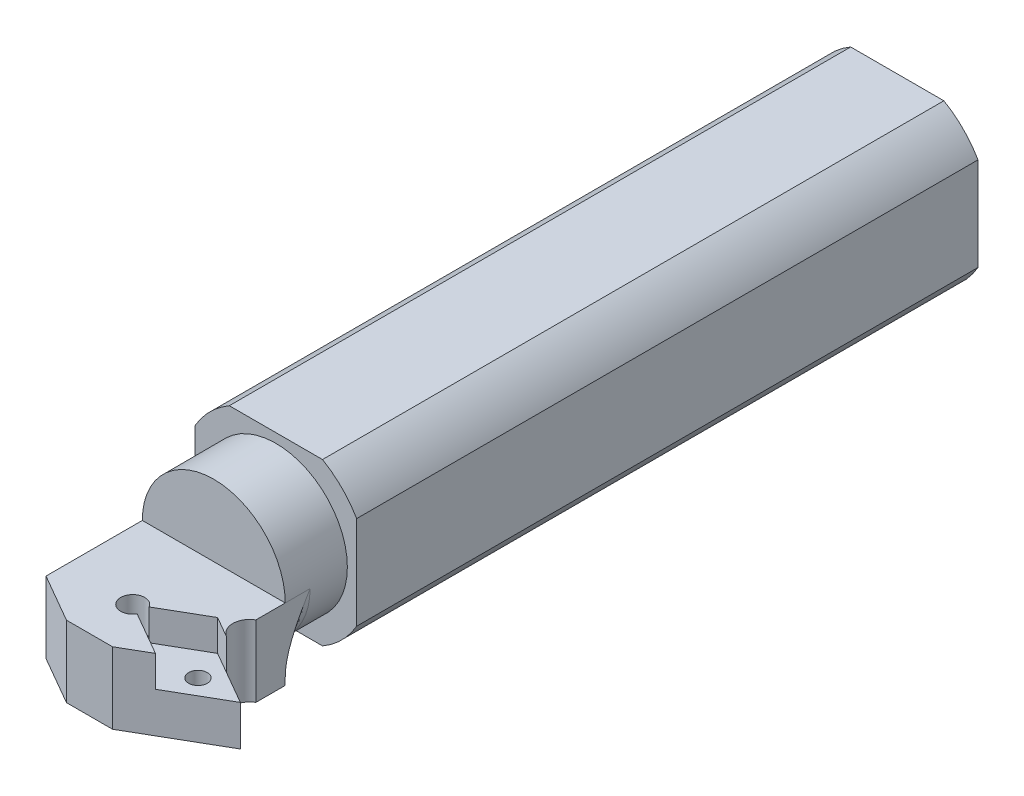
ISO-10303-21;
HEADER;
FILE_DESCRIPTION(('STEP AP214'),'2;1');
FILE_NAME('part.step','',(''),(''),'','','');
FILE_SCHEMA(('AUTOMOTIVE_DESIGN { 1 0 10303 214 1 1 1 1 }'));
ENDSEC;
DATA;
#1=APPLICATION_CONTEXT('core data for automotive mechanical design processes');
#2=APPLICATION_PROTOCOL_DEFINITION('international standard','automotive_design',2000,#1);
#3=PRODUCT_CONTEXT('',#1,'mechanical');
#4=PRODUCT('Part','Part','',(#3));
#5=PRODUCT_RELATED_PRODUCT_CATEGORY('part','',(#4));
#6=PRODUCT_DEFINITION_FORMATION('','',#4);
#7=PRODUCT_DEFINITION_CONTEXT('part definition',#1,'design');
#8=PRODUCT_DEFINITION('design','',#6,#7);
#9=PRODUCT_DEFINITION_SHAPE('','',#8);
#10=(LENGTH_UNIT() NAMED_UNIT(*) SI_UNIT(.MILLI.,.METRE.));
#11=(NAMED_UNIT(*) PLANE_ANGLE_UNIT() SI_UNIT($,.RADIAN.));
#12=(NAMED_UNIT(*) SI_UNIT($,.STERADIAN.) SOLID_ANGLE_UNIT());
#13=UNCERTAINTY_MEASURE_WITH_UNIT(LENGTH_MEASURE(1.E-05),#10,'distance_accuracy_value','');
#14=(GEOMETRIC_REPRESENTATION_CONTEXT(3) GLOBAL_UNCERTAINTY_ASSIGNED_CONTEXT((#13)) GLOBAL_UNIT_ASSIGNED_CONTEXT((#10,
#11,#12)) REPRESENTATION_CONTEXT('',''));
#15=CARTESIAN_POINT('',(0.,0.,0.));
#16=DIRECTION('',(0.,0.,1.));
#17=DIRECTION('',(1.,0.,0.));
#18=AXIS2_PLACEMENT_3D('',#15,#16,#17);
#19=CARTESIAN_POINT('',(16.7468570112552,-19.5147064715622,122.470725692152));
#20=DIRECTION('',(0.499999999999996,0.,-0.866025403784441));
#21=DIRECTION('',(-0.866025403784441,0.,-0.499999999999996));
#22=AXIS2_PLACEMENT_3D('',#19,#20,#21);
#23=PLANE('',#22);
#24=DIRECTION('',(0.,1.,0.));
#25=VECTOR('',#24,1.);
#26=CARTESIAN_POINT('',(11.5,-19.5147064715622,119.441451384305));
#27=LINE('',#26,#25);
#28=CARTESIAN_POINT('',(11.5,-11.5,119.441451384305));
#29=VERTEX_POINT('',#28);
#30=CARTESIAN_POINT('',(11.5,-5.,119.441451384305));
#31=VERTEX_POINT('',#30);
#32=EDGE_CURVE('E257',#29,#31,#27,.T.);
#33=ORIENTED_EDGE('',*,*,#32,.T.);
#34=DIRECTION('',(-0.86602540378444,0.,-0.499999999999998));
#35=VECTOR('',#34,1.);
#36=CARTESIAN_POINT('',(16.7468570112552,-5.,122.470725692152));
#37=LINE('',#36,#35);
#38=CARTESIAN_POINT('',(16.7468570112552,-5.,122.470725692152));
#39=VERTEX_POINT('',#38);
#40=EDGE_CURVE('E52',#39,#31,#37,.T.);
#41=ORIENTED_EDGE('',*,*,#40,.F.);
#42=DIRECTION('',(0.,1.,0.));
#43=VECTOR('',#42,1.);
#44=CARTESIAN_POINT('',(16.7468570112552,-19.5147064715622,122.470725692152));
#45=LINE('',#44,#43);
#46=CARTESIAN_POINT('',(16.7468570112552,-11.5,122.470725692152));
#47=VERTEX_POINT('',#46);
#48=EDGE_CURVE('E252',#47,#39,#45,.T.);
#49=ORIENTED_EDGE('',*,*,#48,.F.);
#50=DIRECTION('',(0.866025403784441,0.,0.499999999999996));
#51=VECTOR('',#50,1.);
#52=CARTESIAN_POINT('',(16.7468570112552,-11.5,122.470725692152));
#53=LINE('',#52,#51);
#54=EDGE_CURVE('E253',#29,#47,#53,.T.);
#55=ORIENTED_EDGE('',*,*,#54,.F.);
#56=EDGE_LOOP('',(#33,#41,#49,#55));
#57=FACE_BOUND('',#56,.T.);
#58=ADVANCED_FACE('F36',(#57),#23,.T.);
#59=CARTESIAN_POINT('',(0.,0.,106.));
#60=DIRECTION('',(0.,0.,1.));
#61=DIRECTION('',(1.,0.,0.));
#62=AXIS2_PLACEMENT_3D('',#59,#60,#61);
#63=TOROIDAL_SURFACE('',#62,15.5,4.);
#64=CARTESIAN_POINT('',(0.,0.,106.));
#65=DIRECTION('',(0.,0.,1.));
#66=DIRECTION('',(1.,0.,0.));
#67=AXIS2_PLACEMENT_3D('',#64,#65,#66);
#68=CIRCLE('',#67,11.5);
#69=CARTESIAN_POINT('',(0.,-11.5,106.));
#70=VERTEX_POINT('',#69);
#71=CARTESIAN_POINT('',(-11.5,0.,106.));
#72=VERTEX_POINT('',#71);
#73=EDGE_CURVE('E504',#70,#72,#68,.F.);
#74=ORIENTED_EDGE('',*,*,#73,.F.);
#75=CARTESIAN_POINT('',(-10.3923048454133,-11.5,110.));
#76=CARTESIAN_POINT('',(-10.2451841637041,-11.5,109.999995353823));
#77=CARTESIAN_POINT('',(-10.0981014925065,-11.5,109.996351872541));
#78=CARTESIAN_POINT('',(-9.80430970715391,-11.5,109.982271051299));
#79=CARTESIAN_POINT('',(-9.65760048024015,-11.5,109.971836090423));
#80=CARTESIAN_POINT('',(-9.2189728978769,-11.5,109.931125310246));
#81=CARTESIAN_POINT('',(-8.92790111409655,-11.5,109.89143924046));
#82=CARTESIAN_POINT('',(-8.35391138957464,-11.5,109.791209104945));
#83=CARTESIAN_POINT('',(-8.07093649289131,-11.5,109.730980649954));
#84=CARTESIAN_POINT('',(-7.50930629539151,-11.5,109.592502408286));
#85=CARTESIAN_POINT('',(-7.23065356345786,-11.5,109.514242311894));
#86=CARTESIAN_POINT('',(-6.64736044802873,-11.5,109.332812570734));
#87=CARTESIAN_POINT('',(-6.34328573757482,-11.5,109.227838663538));
#88=CARTESIAN_POINT('',(-5.74098725075429,-11.5,109.002167712969));
#89=CARTESIAN_POINT('',(-5.44276530894077,-11.5,108.881465827442));
#90=CARTESIAN_POINT('',(-4.5559417041763,-11.5,108.499952640748));
#91=CARTESIAN_POINT('',(-3.9756529329935,-11.5,108.21988963367));
#92=CARTESIAN_POINT('',(-2.82805484305605,-11.5,107.626246509483));
#93=CARTESIAN_POINT('',(-2.26086026559053,-11.5,107.312451926835));
#94=CARTESIAN_POINT('',(-1.13524598700925,-11.5,106.669427325131));
#95=CARTESIAN_POINT('',(-0.57682838525103,-11.5,106.340193686037));
#96=CARTESIAN_POINT('',(-0.0123160279512834,-11.5,106.007263595772));
#97=CARTESIAN_POINT('',(-0.00615801307420656,-11.5,106.003631796708));
#98=CARTESIAN_POINT('',(0.,-11.5,106.));
#99=B_SPLINE_CURVE_WITH_KNOTS('',3,(#75,#76,#77,#78,#79,#80,#81,#82,#83,#84,#85,#86,#87,#88,#89,
#90,#91,#92,#93,#94,#95,#96,#97,#98),.UNSPECIFIED.,.F.,.F.,(4,2,2,2,2,2,2,2,2,2,2,4),(0.,
0.441254468850673,0.882354447492294,1.76260081662264,2.62989068160847,3.49767766159483,
4.46219925938463,5.42701850799611,7.35813850539926,9.30235757735884,11.2470348176778,
11.2684824282677),.UNSPECIFIED.);
#100=CARTESIAN_POINT('',(-10.3923048454133,-11.5,110.));
#101=VERTEX_POINT('',#100);
#102=EDGE_CURVE('E460',#70,#101,#99,.F.);
#103=ORIENTED_EDGE('',*,*,#102,.T.);
#104=CARTESIAN_POINT('',(0.,0.,110.));
#105=DIRECTION('',(0.,0.,1.));
#106=DIRECTION('',(1.,0.,0.));
#107=AXIS2_PLACEMENT_3D('',#104,#105,#106);
#108=CIRCLE('',#107,15.5);
#109=CARTESIAN_POINT('',(-11.5,-10.3923048454133,110.));
#110=VERTEX_POINT('',#109);
#111=EDGE_CURVE('E505',#110,#101,#108,.T.);
#112=ORIENTED_EDGE('',*,*,#111,.F.);
#113=CARTESIAN_POINT('',(-11.5,-10.3923048454133,110.));
#114=CARTESIAN_POINT('',(-11.5,-10.2451841637041,109.999995353823));
#115=CARTESIAN_POINT('',(-11.5,-10.0981014925065,109.996351872541));
#116=CARTESIAN_POINT('',(-11.5,-9.80430970715391,109.982271051299));
#117=CARTESIAN_POINT('',(-11.5,-9.65760048024015,109.971836090423));
#118=CARTESIAN_POINT('',(-11.5,-9.2189728978769,109.931125310246));
#119=CARTESIAN_POINT('',(-11.5,-8.92790111409655,109.89143924046));
#120=CARTESIAN_POINT('',(-11.5,-8.35391138957464,109.791209104945));
#121=CARTESIAN_POINT('',(-11.5,-8.07093649289131,109.730980649954));
#122=CARTESIAN_POINT('',(-11.5,-7.50930629539151,109.592502408286));
#123=CARTESIAN_POINT('',(-11.5,-7.23065356345786,109.514242311894));
#124=CARTESIAN_POINT('',(-11.5,-6.64736044802873,109.332812570734));
#125=CARTESIAN_POINT('',(-11.5,-6.34328573757482,109.227838663538));
#126=CARTESIAN_POINT('',(-11.5,-5.74098725075429,109.002167712969));
#127=CARTESIAN_POINT('',(-11.5,-5.44276530894077,108.881465827442));
#128=CARTESIAN_POINT('',(-11.5,-4.5559417041763,108.499952640748));
#129=CARTESIAN_POINT('',(-11.5,-3.9756529329935,108.21988963367));
#130=CARTESIAN_POINT('',(-11.5,-2.82805484305605,107.626246509483));
#131=CARTESIAN_POINT('',(-11.5,-2.26086026559053,107.312451926835));
#132=CARTESIAN_POINT('',(-11.5,-1.13524598700925,106.669427325131));
#133=CARTESIAN_POINT('',(-11.5,-0.57682838525103,106.340193686037));
#134=CARTESIAN_POINT('',(-11.5,-0.0123160279512834,106.007263595772));
#135=CARTESIAN_POINT('',(-11.5,-0.00615801307420656,106.003631796708));
#136=CARTESIAN_POINT('',(-11.5,0.,106.));
#137=B_SPLINE_CURVE_WITH_KNOTS('',3,(#113,#114,#115,#116,#117,#118,#119,#120,#121,#122,#123,
#124,#125,#126,#127,#128,#129,#130,#131,#132,#133,#134,#135,#136),.UNSPECIFIED.,.F.,.F.,(4,2,2,
2,2,2,2,2,2,2,2,4),(0.,0.441254468850673,0.882354447492294,1.76260081662264,2.62989068160847,
3.49767766159483,4.46219925938463,5.42701850799611,7.35813850539926,9.30235757735884,
11.2470348176778,11.2684824282677),.UNSPECIFIED.);
#138=EDGE_CURVE('E454',#110,#72,#137,.T.);
#139=ORIENTED_EDGE('',*,*,#138,.T.);
#140=EDGE_LOOP('',(#74,#103,#112,#139));
#141=FACE_BOUND('',#140,.T.);
#142=ADVANCED_FACE('F38',(#141),#63,.F.);
#143=CARTESIAN_POINT('',(0.,0.,106.));
#144=DIRECTION('',(0.,0.,1.));
#145=DIRECTION('',(1.,0.,0.));
#146=AXIS2_PLACEMENT_3D('',#143,#144,#145);
#147=TOROIDAL_SURFACE('',#146,15.5,4.);
#148=CARTESIAN_POINT('',(0.,0.,106.));
#149=DIRECTION('',(0.,0.,1.));
#150=DIRECTION('',(1.,0.,0.));
#151=AXIS2_PLACEMENT_3D('',#148,#149,#150);
#152=CIRCLE('',#151,11.5);
#153=CARTESIAN_POINT('',(11.5,0.,106.));
#154=VERTEX_POINT('',#153);
#155=CARTESIAN_POINT('',(7.71041972401629,-8.53225806451613,106.));
#156=VERTEX_POINT('',#155);
#157=EDGE_CURVE('E366',#154,#156,#152,.F.);
#158=ORIENTED_EDGE('',*,*,#157,.F.);
#159=CARTESIAN_POINT('',(11.5,-10.3923048454133,110.));
#160=CARTESIAN_POINT('',(11.5,-10.2451841637041,109.999995353823));
#161=CARTESIAN_POINT('',(11.5,-10.0981014925065,109.996351872541));
#162=CARTESIAN_POINT('',(11.5,-9.80430970715391,109.982271051299));
#163=CARTESIAN_POINT('',(11.5,-9.65760048024015,109.971836090423));
#164=CARTESIAN_POINT('',(11.5,-9.2189728978769,109.931125310246));
#165=CARTESIAN_POINT('',(11.5,-8.92790111409655,109.89143924046));
#166=CARTESIAN_POINT('',(11.5,-8.35391138957464,109.791209104945));
#167=CARTESIAN_POINT('',(11.5,-8.07093649289131,109.730980649954));
#168=CARTESIAN_POINT('',(11.5,-7.50930629539151,109.592502408286));
#169=CARTESIAN_POINT('',(11.5,-7.23065356345786,109.514242311894));
#170=CARTESIAN_POINT('',(11.5,-6.64736044802873,109.332812570734));
#171=CARTESIAN_POINT('',(11.5,-6.34328573757482,109.227838663538));
#172=CARTESIAN_POINT('',(11.5,-5.74098725075429,109.002167712969));
#173=CARTESIAN_POINT('',(11.5,-5.44276530894077,108.881465827442));
#174=CARTESIAN_POINT('',(11.5,-4.5559417041763,108.499952640748));
#175=CARTESIAN_POINT('',(11.5,-3.9756529329935,108.21988963367));
#176=CARTESIAN_POINT('',(11.5,-2.82805484305605,107.626246509483));
#177=CARTESIAN_POINT('',(11.5,-2.26086026559053,107.312451926835));
#178=CARTESIAN_POINT('',(11.5,-1.13524598700925,106.669427325131));
#179=CARTESIAN_POINT('',(11.5,-0.57682838525103,106.340193686037));
#180=CARTESIAN_POINT('',(11.5,-0.0123160279512834,106.007263595772));
#181=CARTESIAN_POINT('',(11.5,-0.00615801307420656,106.003631796708));
#182=CARTESIAN_POINT('',(11.5,0.,106.));
#183=B_SPLINE_CURVE_WITH_KNOTS('',3,(#159,#160,#161,#162,#163,#164,#165,#166,#167,#168,#169,
#170,#171,#172,#173,#174,#175,#176,#177,#178,#179,#180,#181,#182),.UNSPECIFIED.,.F.,.F.,(4,2,2,
2,2,2,2,2,2,2,2,4),(0.,0.441254468850673,0.882354447492294,1.76260081662264,2.62989068160847,
3.49767766159483,4.46219925938463,5.42701850799611,7.35813850539926,9.30235757735884,
11.2470348176778,11.2684824282677),.UNSPECIFIED.);
#184=CARTESIAN_POINT('',(11.5,-10.3923048454133,110.));
#185=VERTEX_POINT('',#184);
#186=EDGE_CURVE('E374',#154,#185,#183,.F.);
#187=ORIENTED_EDGE('',*,*,#186,.T.);
#188=CARTESIAN_POINT('',(0.,0.,110.));
#189=DIRECTION('',(0.,0.,1.));
#190=DIRECTION('',(1.,0.,0.));
#191=AXIS2_PLACEMENT_3D('',#188,#189,#190);
#192=CIRCLE('',#191,15.5);
#193=CARTESIAN_POINT('',(10.3923048454133,-11.5,110.));
#194=VERTEX_POINT('',#193);
#195=EDGE_CURVE('E371',#194,#185,#192,.T.);
#196=ORIENTED_EDGE('',*,*,#195,.F.);
#197=CARTESIAN_POINT('',(10.3923048454133,-11.5,110.));
#198=CARTESIAN_POINT('',(10.2451841637041,-11.5,109.999995353823));
#199=CARTESIAN_POINT('',(10.0981014925065,-11.5,109.996351872541));
#200=CARTESIAN_POINT('',(9.80430970715391,-11.5,109.982271051299));
#201=CARTESIAN_POINT('',(9.65760048024015,-11.5,109.971836090423));
#202=CARTESIAN_POINT('',(9.2189728978769,-11.5,109.931125310246));
#203=CARTESIAN_POINT('',(8.92790111409655,-11.5,109.89143924046));
#204=CARTESIAN_POINT('',(8.35391138957464,-11.5,109.791209104945));
#205=CARTESIAN_POINT('',(8.07093649289131,-11.5,109.730980649954));
#206=CARTESIAN_POINT('',(7.50930629539151,-11.5,109.592502408286));
#207=CARTESIAN_POINT('',(7.23065356345786,-11.5,109.514242311894));
#208=CARTESIAN_POINT('',(6.64736044802873,-11.5,109.332812570734));
#209=CARTESIAN_POINT('',(6.34328573757482,-11.5,109.227838663538));
#210=CARTESIAN_POINT('',(5.74098725075429,-11.5,109.002167712969));
#211=CARTESIAN_POINT('',(5.44276530894077,-11.5,108.881465827442));
#212=CARTESIAN_POINT('',(4.5559417041763,-11.5,108.499952640748));
#213=CARTESIAN_POINT('',(3.9756529329935,-11.5,108.21988963367));
#214=CARTESIAN_POINT('',(2.82805484305605,-11.5,107.626246509483));
#215=CARTESIAN_POINT('',(2.26086026559053,-11.5,107.312451926835));
#216=CARTESIAN_POINT('',(1.13524598700925,-11.5,106.669427325131));
#217=CARTESIAN_POINT('',(0.57682838525103,-11.5,106.340193686037));
#218=CARTESIAN_POINT('',(0.0123160279512834,-11.5,106.007263595772));
#219=CARTESIAN_POINT('',(0.00615801307420656,-11.5,106.003631796708));
#220=CARTESIAN_POINT('',(0.,-11.5,106.));
#221=B_SPLINE_CURVE_WITH_KNOTS('',3,(#197,#198,#199,#200,#201,#202,#203,#204,#205,#206,#207,
#208,#209,#210,#211,#212,#213,#214,#215,#216,#217,#218,#219,#220),.UNSPECIFIED.,.F.,.F.,(4,2,2,
2,2,2,2,2,2,2,2,4),(0.,0.441254468850673,0.882354447492294,1.76260081662264,2.62989068160847,
3.49767766159483,4.46219925938463,5.42701850799611,7.35813850539926,9.30235757735884,
11.2470348176778,11.2684824282677),.UNSPECIFIED.);
#222=EDGE_CURVE('E381',#194,#70,#221,.T.);
#223=ORIENTED_EDGE('',*,*,#222,.T.);
#224=CARTESIAN_POINT('',(0.,0.,106.));
#225=DIRECTION('',(0.,0.,1.));
#226=DIRECTION('',(1.,0.,0.));
#227=AXIS2_PLACEMENT_3D('',#224,#225,#226);
#228=CIRCLE('',#227,11.5);
#229=EDGE_CURVE('E363',#156,#70,#228,.F.);
#230=ORIENTED_EDGE('',*,*,#229,.F.);
#231=EDGE_LOOP('',(#158,#187,#196,#223,#230));
#232=FACE_BOUND('',#231,.T.);
#233=ADVANCED_FACE('F391',(#232),#147,.F.);
#234=CARTESIAN_POINT('',(0.,0.,100.));
#235=DIRECTION('',(0.,0.,1.));
#236=DIRECTION('',(1.,0.,0.));
#237=AXIS2_PLACEMENT_3D('',#234,#235,#236);
#238=PLANE('',#237);
#239=CARTESIAN_POINT('',(0.,0.,100.));
#240=DIRECTION('',(0.,0.,1.));
#241=DIRECTION('',(1.,0.,0.));
#242=AXIS2_PLACEMENT_3D('',#239,#240,#241);
#243=CIRCLE('',#242,15.);
#244=CARTESIAN_POINT('',(-7.5,12.9903810567666,100.));
#245=VERTEX_POINT('',#244);
#246=CARTESIAN_POINT('',(-12.9903810567666,7.5,100.));
#247=VERTEX_POINT('',#246);
#248=EDGE_CURVE('E306',#245,#247,#243,.T.);
#249=ORIENTED_EDGE('',*,*,#248,.T.);
#250=DIRECTION('',(0.,-1.,0.));
#251=VECTOR('',#250,1.);
#252=CARTESIAN_POINT('',(-12.9903810567666,7.5,100.));
#253=LINE('',#252,#251);
#254=CARTESIAN_POINT('',(-12.9903810567666,-7.5,100.));
#255=VERTEX_POINT('',#254);
#256=EDGE_CURVE('E309',#247,#255,#253,.T.);
#257=ORIENTED_EDGE('',*,*,#256,.T.);
#258=CARTESIAN_POINT('',(0.,0.,100.));
#259=DIRECTION('',(0.,0.,1.));
#260=DIRECTION('',(1.,0.,0.));
#261=AXIS2_PLACEMENT_3D('',#258,#259,#260);
#262=CIRCLE('',#261,15.);
#263=CARTESIAN_POINT('',(-7.5,-12.9903810567666,100.));
#264=VERTEX_POINT('',#263);
#265=EDGE_CURVE('E312',#255,#264,#262,.T.);
#266=ORIENTED_EDGE('',*,*,#265,.T.);
#267=DIRECTION('',(1.,0.,0.));
#268=VECTOR('',#267,1.);
#269=CARTESIAN_POINT('',(7.5,-12.9903810567666,100.));
#270=LINE('',#269,#268);
#271=CARTESIAN_POINT('',(7.49999999999999,-12.9903810567666,100.));
#272=VERTEX_POINT('',#271);
#273=EDGE_CURVE('E314',#264,#272,#270,.T.);
#274=ORIENTED_EDGE('',*,*,#273,.T.);
#275=CARTESIAN_POINT('',(0.,0.,100.));
#276=DIRECTION('',(0.,0.,1.));
#277=DIRECTION('',(1.,0.,0.));
#278=AXIS2_PLACEMENT_3D('',#275,#276,#277);
#279=CIRCLE('',#278,15.);
#280=CARTESIAN_POINT('',(12.9903810567666,-7.5,100.));
#281=VERTEX_POINT('',#280);
#282=EDGE_CURVE('E316',#272,#281,#279,.T.);
#283=ORIENTED_EDGE('',*,*,#282,.T.);
#284=DIRECTION('',(0.,1.,0.));
#285=VECTOR('',#284,1.);
#286=CARTESIAN_POINT('',(12.9903810567666,7.5,100.));
#287=LINE('',#286,#285);
#288=CARTESIAN_POINT('',(12.9903810567666,7.5,100.));
#289=VERTEX_POINT('',#288);
#290=EDGE_CURVE('E318',#281,#289,#287,.T.);
#291=ORIENTED_EDGE('',*,*,#290,.T.);
#292=CARTESIAN_POINT('',(0.,0.,100.));
#293=DIRECTION('',(0.,0.,1.));
#294=DIRECTION('',(1.,0.,0.));
#295=AXIS2_PLACEMENT_3D('',#292,#293,#294);
#296=CIRCLE('',#295,15.);
#297=CARTESIAN_POINT('',(7.5,12.9903810567666,100.));
#298=VERTEX_POINT('',#297);
#299=EDGE_CURVE('E320',#289,#298,#296,.T.);
#300=ORIENTED_EDGE('',*,*,#299,.T.);
#301=DIRECTION('',(-1.,0.,0.));
#302=VECTOR('',#301,1.);
#303=CARTESIAN_POINT('',(-7.5,12.9903810567666,100.));
#304=LINE('',#303,#302);
#305=EDGE_CURVE('E322',#298,#245,#304,.T.);
#306=ORIENTED_EDGE('',*,*,#305,.T.);
#307=EDGE_LOOP('',(#249,#257,#266,#274,#283,#291,#300,#306));
#308=FACE_BOUND('',#307,.T.);
#309=CARTESIAN_POINT('',(0.,0.,100.));
#310=DIRECTION('',(0.,0.,1.));
#311=DIRECTION('',(1.,0.,0.));
#312=AXIS2_PLACEMENT_3D('',#309,#310,#311);
#313=CIRCLE('',#312,11.5);
#314=CARTESIAN_POINT('',(11.5,0.,100.));
#315=VERTEX_POINT('',#314);
#316=EDGE_CURVE('E299',#315,#315,#313,.T.);
#317=ORIENTED_EDGE('',*,*,#316,.F.);
#318=EDGE_LOOP('',(#317));
#319=FACE_BOUND('',#318,.T.);
#320=ADVANCED_FACE('F395',(#308,#319),#238,.T.);
#321=CARTESIAN_POINT('',(0.,0.,100.));
#322=DIRECTION('',(0.,0.,-1.));
#323=DIRECTION('',(-1.,0.,0.));
#324=AXIS2_PLACEMENT_3D('',#321,#322,#323);
#325=CYLINDRICAL_SURFACE('',#324,15.);
#326=CARTESIAN_POINT('',(0.,0.,0.));
#327=DIRECTION('',(0.,0.,1.));
#328=DIRECTION('',(1.,0.,0.));
#329=AXIS2_PLACEMENT_3D('',#326,#327,#328);
#330=CIRCLE('',#329,15.);
#331=CARTESIAN_POINT('',(-7.5,12.9903810567666,0.));
#332=VERTEX_POINT('',#331);
#333=CARTESIAN_POINT('',(-12.9903810567666,7.5,0.));
#334=VERTEX_POINT('',#333);
#335=EDGE_CURVE('E303',#332,#334,#330,.T.);
#336=ORIENTED_EDGE('',*,*,#335,.T.);
#337=DIRECTION('',(0.,0.,-1.));
#338=VECTOR('',#337,1.);
#339=CARTESIAN_POINT('',(-12.9903810567666,7.5,100.));
#340=LINE('',#339,#338);
#341=EDGE_CURVE('E360',#247,#334,#340,.T.);
#342=ORIENTED_EDGE('',*,*,#341,.F.);
#343=ORIENTED_EDGE('',*,*,#248,.F.);
#344=DIRECTION('',(0.,0.,-1.));
#345=VECTOR('',#344,1.);
#346=CARTESIAN_POINT('',(-7.5,12.9903810567666,100.));
#347=LINE('',#346,#345);
#348=EDGE_CURVE('E324',#245,#332,#347,.T.);
#349=ORIENTED_EDGE('',*,*,#348,.T.);
#350=EDGE_LOOP('',(#336,#342,#343,#349));
#351=FACE_BOUND('',#350,.T.);
#352=ADVANCED_FACE('F397',(#351),#325,.T.);
#353=CARTESIAN_POINT('',(-12.9903810567666,7.5,100.));
#354=DIRECTION('',(1.,0.,0.));
#355=DIRECTION('',(0.,0.,-1.));
#356=AXIS2_PLACEMENT_3D('',#353,#354,#355);
#357=PLANE('',#356);
#358=DIRECTION('',(0.,-1.,0.));
#359=VECTOR('',#358,1.);
#360=CARTESIAN_POINT('',(-12.9903810567666,7.5,0.));
#361=LINE('',#360,#359);
#362=CARTESIAN_POINT('',(-12.9903810567666,-7.5,0.));
#363=VERTEX_POINT('',#362);
#364=EDGE_CURVE('E327',#334,#363,#361,.T.);
#365=ORIENTED_EDGE('',*,*,#364,.T.);
#366=DIRECTION('',(0.,0.,-1.));
#367=VECTOR('',#366,1.);
#368=CARTESIAN_POINT('',(-12.9903810567666,-7.5,100.));
#369=LINE('',#368,#367);
#370=EDGE_CURVE('E357',#255,#363,#369,.T.);
#371=ORIENTED_EDGE('',*,*,#370,.F.);
#372=ORIENTED_EDGE('',*,*,#256,.F.);
#373=ORIENTED_EDGE('',*,*,#341,.T.);
#374=EDGE_LOOP('',(#365,#371,#372,#373));
#375=FACE_BOUND('',#374,.T.);
#376=ADVANCED_FACE('F401',(#375),#357,.F.);
#377=CARTESIAN_POINT('',(0.,0.,100.));
#378=DIRECTION('',(0.,0.,-1.));
#379=DIRECTION('',(-1.,0.,0.));
#380=AXIS2_PLACEMENT_3D('',#377,#378,#379);
#381=CYLINDRICAL_SURFACE('',#380,15.);
#382=CARTESIAN_POINT('',(0.,0.,0.));
#383=DIRECTION('',(0.,0.,1.));
#384=DIRECTION('',(1.,0.,0.));
#385=AXIS2_PLACEMENT_3D('',#382,#383,#384);
#386=CIRCLE('',#385,15.);
#387=CARTESIAN_POINT('',(-7.5,-12.9903810567666,0.));
#388=VERTEX_POINT('',#387);
#389=EDGE_CURVE('E329',#363,#388,#386,.T.);
#390=ORIENTED_EDGE('',*,*,#389,.T.);
#391=DIRECTION('',(0.,0.,-1.));
#392=VECTOR('',#391,1.);
#393=CARTESIAN_POINT('',(-7.5,-12.9903810567666,100.));
#394=LINE('',#393,#392);
#395=EDGE_CURVE('E354',#264,#388,#394,.T.);
#396=ORIENTED_EDGE('',*,*,#395,.F.);
#397=ORIENTED_EDGE('',*,*,#265,.F.);
#398=ORIENTED_EDGE('',*,*,#370,.T.);
#399=EDGE_LOOP('',(#390,#396,#397,#398));
#400=FACE_BOUND('',#399,.T.);
#401=ADVANCED_FACE('F405',(#400),#381,.T.);
#402=CARTESIAN_POINT('',(7.5,-12.9903810567666,100.));
#403=DIRECTION('',(0.,1.,0.));
#404=DIRECTION('',(0.,0.,1.));
#405=AXIS2_PLACEMENT_3D('',#402,#403,#404);
#406=PLANE('',#405);
#407=DIRECTION('',(1.,0.,0.));
#408=VECTOR('',#407,1.);
#409=CARTESIAN_POINT('',(7.5,-12.9903810567666,0.));
#410=LINE('',#409,#408);
#411=CARTESIAN_POINT('',(7.49999999999999,-12.9903810567666,0.));
#412=VERTEX_POINT('',#411);
#413=EDGE_CURVE('E331',#388,#412,#410,.T.);
#414=ORIENTED_EDGE('',*,*,#413,.T.);
#415=DIRECTION('',(0.,0.,-1.));
#416=VECTOR('',#415,1.);
#417=CARTESIAN_POINT('',(7.49999999999999,-12.9903810567666,100.));
#418=LINE('',#417,#416);
#419=EDGE_CURVE('E351',#272,#412,#418,.T.);
#420=ORIENTED_EDGE('',*,*,#419,.F.);
#421=ORIENTED_EDGE('',*,*,#273,.F.);
#422=ORIENTED_EDGE('',*,*,#395,.T.);
#423=EDGE_LOOP('',(#414,#420,#421,#422));
#424=FACE_BOUND('',#423,.T.);
#425=ADVANCED_FACE('F409',(#424),#406,.F.);
#426=CARTESIAN_POINT('',(0.,0.,100.));
#427=DIRECTION('',(0.,0.,-1.));
#428=DIRECTION('',(-1.,0.,0.));
#429=AXIS2_PLACEMENT_3D('',#426,#427,#428);
#430=CYLINDRICAL_SURFACE('',#429,15.);
#431=CARTESIAN_POINT('',(0.,0.,0.));
#432=DIRECTION('',(0.,0.,1.));
#433=DIRECTION('',(1.,0.,0.));
#434=AXIS2_PLACEMENT_3D('',#431,#432,#433);
#435=CIRCLE('',#434,15.);
#436=CARTESIAN_POINT('',(12.9903810567666,-7.5,0.));
#437=VERTEX_POINT('',#436);
#438=EDGE_CURVE('E333',#412,#437,#435,.T.);
#439=ORIENTED_EDGE('',*,*,#438,.T.);
#440=DIRECTION('',(0.,0.,-1.));
#441=VECTOR('',#440,1.);
#442=CARTESIAN_POINT('',(12.9903810567666,-7.5,100.));
#443=LINE('',#442,#441);
#444=EDGE_CURVE('E348',#281,#437,#443,.T.);
#445=ORIENTED_EDGE('',*,*,#444,.F.);
#446=ORIENTED_EDGE('',*,*,#282,.F.);
#447=ORIENTED_EDGE('',*,*,#419,.T.);
#448=EDGE_LOOP('',(#439,#445,#446,#447));
#449=FACE_BOUND('',#448,.T.);
#450=ADVANCED_FACE('F413',(#449),#430,.T.);
#451=CARTESIAN_POINT('',(12.9903810567666,7.5,100.));
#452=DIRECTION('',(-1.,0.,0.));
#453=DIRECTION('',(0.,0.,1.));
#454=AXIS2_PLACEMENT_3D('',#451,#452,#453);
#455=PLANE('',#454);
#456=DIRECTION('',(0.,1.,0.));
#457=VECTOR('',#456,1.);
#458=CARTESIAN_POINT('',(12.9903810567666,7.5,0.));
#459=LINE('',#458,#457);
#460=CARTESIAN_POINT('',(12.9903810567666,7.5,0.));
#461=VERTEX_POINT('',#460);
#462=EDGE_CURVE('E335',#437,#461,#459,.T.);
#463=ORIENTED_EDGE('',*,*,#462,.T.);
#464=DIRECTION('',(0.,0.,-1.));
#465=VECTOR('',#464,1.);
#466=CARTESIAN_POINT('',(12.9903810567666,7.5,100.));
#467=LINE('',#466,#465);
#468=EDGE_CURVE('E345',#289,#461,#467,.T.);
#469=ORIENTED_EDGE('',*,*,#468,.F.);
#470=ORIENTED_EDGE('',*,*,#290,.F.);
#471=ORIENTED_EDGE('',*,*,#444,.T.);
#472=EDGE_LOOP('',(#463,#469,#470,#471));
#473=FACE_BOUND('',#472,.T.);
#474=ADVANCED_FACE('F417',(#473),#455,.F.);
#475=CARTESIAN_POINT('',(0.,0.,100.));
#476=DIRECTION('',(0.,0.,-1.));
#477=DIRECTION('',(-1.,0.,0.));
#478=AXIS2_PLACEMENT_3D('',#475,#476,#477);
#479=CYLINDRICAL_SURFACE('',#478,15.);
#480=CARTESIAN_POINT('',(0.,0.,0.));
#481=DIRECTION('',(0.,0.,1.));
#482=DIRECTION('',(1.,0.,0.));
#483=AXIS2_PLACEMENT_3D('',#480,#481,#482);
#484=CIRCLE('',#483,15.);
#485=CARTESIAN_POINT('',(7.5,12.9903810567666,0.));
#486=VERTEX_POINT('',#485);
#487=EDGE_CURVE('E337',#461,#486,#484,.T.);
#488=ORIENTED_EDGE('',*,*,#487,.T.);
#489=DIRECTION('',(0.,0.,-1.));
#490=VECTOR('',#489,1.);
#491=CARTESIAN_POINT('',(7.5,12.9903810567666,100.));
#492=LINE('',#491,#490);
#493=EDGE_CURVE('E342',#298,#486,#492,.T.);
#494=ORIENTED_EDGE('',*,*,#493,.F.);
#495=ORIENTED_EDGE('',*,*,#299,.F.);
#496=ORIENTED_EDGE('',*,*,#468,.T.);
#497=EDGE_LOOP('',(#488,#494,#495,#496));
#498=FACE_BOUND('',#497,.T.);
#499=ADVANCED_FACE('F421',(#498),#479,.T.);
#500=CARTESIAN_POINT('',(-7.5,12.9903810567666,100.));
#501=DIRECTION('',(0.,-1.,0.));
#502=DIRECTION('',(0.,0.,-1.));
#503=AXIS2_PLACEMENT_3D('',#500,#501,#502);
#504=PLANE('',#503);
#505=DIRECTION('',(-1.,0.,0.));
#506=VECTOR('',#505,1.);
#507=CARTESIAN_POINT('',(-7.5,12.9903810567666,0.));
#508=LINE('',#507,#506);
#509=EDGE_CURVE('E310',#486,#332,#508,.T.);
#510=ORIENTED_EDGE('',*,*,#509,.T.);
#511=ORIENTED_EDGE('',*,*,#348,.F.);
#512=ORIENTED_EDGE('',*,*,#305,.F.);
#513=ORIENTED_EDGE('',*,*,#493,.T.);
#514=EDGE_LOOP('',(#510,#511,#512,#513));
#515=FACE_BOUND('',#514,.T.);
#516=ADVANCED_FACE('F425',(#515),#504,.F.);
#517=CARTESIAN_POINT('',(0.,0.,0.));
#518=DIRECTION('',(0.,0.,1.));
#519=DIRECTION('',(1.,0.,0.));
#520=AXIS2_PLACEMENT_3D('',#517,#518,#519);
#521=PLANE('',#520);
#522=ORIENTED_EDGE('',*,*,#335,.F.);
#523=ORIENTED_EDGE('',*,*,#509,.F.);
#524=ORIENTED_EDGE('',*,*,#487,.F.);
#525=ORIENTED_EDGE('',*,*,#462,.F.);
#526=ORIENTED_EDGE('',*,*,#438,.F.);
#527=ORIENTED_EDGE('',*,*,#413,.F.);
#528=ORIENTED_EDGE('',*,*,#389,.F.);
#529=ORIENTED_EDGE('',*,*,#364,.F.);
#530=EDGE_LOOP('',(#522,#523,#524,#525,#526,#527,#528,#529));
#531=FACE_BOUND('',#530,.T.);
#532=ADVANCED_FACE('F429',(#531),#521,.F.);
#533=CARTESIAN_POINT('',(0.,0.,110.));
#534=DIRECTION('',(0.,0.,-1.));
#535=DIRECTION('',(-1.,0.,0.));
#536=AXIS2_PLACEMENT_3D('',#533,#534,#535);
#537=CYLINDRICAL_SURFACE('',#536,11.5);
#538=ORIENTED_EDGE('',*,*,#229,.T.);
#539=ORIENTED_EDGE('',*,*,#73,.T.);
#540=DIRECTION('',(0.,0.,-1.));
#541=VECTOR('',#540,1.);
#542=CARTESIAN_POINT('',(-11.5,0.,110.));
#543=LINE('',#542,#541);
#544=CARTESIAN_POINT('',(-11.5,0.,110.));
#545=VERTEX_POINT('',#544);
#546=EDGE_CURVE('E502',#72,#545,#543,.F.);
#547=ORIENTED_EDGE('',*,*,#546,.T.);
#548=CARTESIAN_POINT('',(0.,0.,110.));
#549=DIRECTION('',(0.,0.,1.));
#550=DIRECTION('',(1.,0.,0.));
#551=AXIS2_PLACEMENT_3D('',#548,#549,#550);
#552=CIRCLE('',#551,11.5);
#553=CARTESIAN_POINT('',(11.5,0.,110.));
#554=VERTEX_POINT('',#553);
#555=EDGE_CURVE('E300',#554,#545,#552,.T.);
#556=ORIENTED_EDGE('',*,*,#555,.F.);
#557=DIRECTION('',(0.,0.,-1.));
#558=VECTOR('',#557,1.);
#559=CARTESIAN_POINT('',(11.5,0.,110.));
#560=LINE('',#559,#558);
#561=EDGE_CURVE('E368',#554,#154,#560,.T.);
#562=ORIENTED_EDGE('',*,*,#561,.T.);
#563=ORIENTED_EDGE('',*,*,#157,.T.);
#564=EDGE_LOOP('',(#538,#539,#547,#556,#562,#563));
#565=FACE_BOUND('',#564,.T.);
#566=ORIENTED_EDGE('',*,*,#316,.T.);
#567=EDGE_LOOP('',(#566));
#568=FACE_BOUND('',#567,.T.);
#569=ADVANCED_FACE('F433',(#565,#568),#537,.T.);
#570=CARTESIAN_POINT('',(0.,0.,110.));
#571=DIRECTION('',(0.,0.,1.));
#572=DIRECTION('',(1.,0.,0.));
#573=AXIS2_PLACEMENT_3D('',#570,#571,#572);
#574=PLANE('',#573);
#575=DIRECTION('',(-1.,0.,0.));
#576=VECTOR('',#575,1.);
#577=CARTESIAN_POINT('',(-11.5,0.,110.));
#578=LINE('',#577,#576);
#579=EDGE_CURVE('E277',#554,#545,#578,.T.);
#580=ORIENTED_EDGE('',*,*,#579,.F.);
#581=ORIENTED_EDGE('',*,*,#555,.T.);
#582=EDGE_LOOP('',(#580,#581));
#583=FACE_BOUND('',#582,.T.);
#584=ADVANCED_FACE('F440',(#583),#574,.T.);
#585=CARTESIAN_POINT('',(0.,0.,110.));
#586=DIRECTION('',(0.,0.,1.));
#587=DIRECTION('',(1.,0.,0.));
#588=AXIS2_PLACEMENT_3D('',#585,#586,#587);
#589=PLANE('',#588);
#590=DIRECTION('',(0.,-1.,0.));
#591=VECTOR('',#590,1.);
#592=CARTESIAN_POINT('',(-11.5,0.,110.));
#593=LINE('',#592,#591);
#594=CARTESIAN_POINT('',(-11.5,-11.5,110.));
#595=VERTEX_POINT('',#594);
#596=EDGE_CURVE('E273',#110,#595,#593,.T.);
#597=ORIENTED_EDGE('',*,*,#596,.F.);
#598=ORIENTED_EDGE('',*,*,#111,.T.);
#599=DIRECTION('',(1.,0.,0.));
#600=VECTOR('',#599,1.);
#601=CARTESIAN_POINT('',(-11.5,-11.5,110.));
#602=LINE('',#601,#600);
#603=EDGE_CURVE('E284',#595,#101,#602,.T.);
#604=ORIENTED_EDGE('',*,*,#603,.F.);
#605=EDGE_LOOP('',(#597,#598,#604));
#606=FACE_BOUND('',#605,.T.);
#607=ADVANCED_FACE('F444',(#606),#589,.F.);
#608=CARTESIAN_POINT('',(11.5,-11.5,110.));
#609=VERTEX_POINT('',#608);
#610=EDGE_CURVE('E283',#194,#609,#602,.T.);
#611=ORIENTED_EDGE('',*,*,#610,.F.);
#612=ORIENTED_EDGE('',*,*,#195,.T.);
#613=DIRECTION('',(0.,1.,0.));
#614=VECTOR('',#613,1.);
#615=CARTESIAN_POINT('',(11.5,0.,110.));
#616=LINE('',#615,#614);
#617=EDGE_CURVE('E287',#609,#185,#616,.T.);
#618=ORIENTED_EDGE('',*,*,#617,.F.);
#619=EDGE_LOOP('',(#611,#612,#618));
#620=FACE_BOUND('',#619,.T.);
#621=ADVANCED_FACE('F450',(#620),#589,.F.);
#622=CARTESIAN_POINT('',(-11.5,0.,130.));
#623=DIRECTION('',(1.,0.,0.));
#624=DIRECTION('',(0.,0.,-1.));
#625=AXIS2_PLACEMENT_3D('',#622,#623,#624);
#626=PLANE('',#625);
#627=DIRECTION('',(0.,0.,-1.));
#628=VECTOR('',#627,1.);
#629=CARTESIAN_POINT('',(-11.5,-11.5,130.));
#630=LINE('',#629,#628);
#631=CARTESIAN_POINT('',(-11.5,-11.5,125.5));
#632=VERTEX_POINT('',#631);
#633=EDGE_CURVE('E297',#632,#595,#630,.T.);
#634=ORIENTED_EDGE('',*,*,#633,.F.);
#635=DIRECTION('',(0.,1.,0.));
#636=VECTOR('',#635,1.);
#637=CARTESIAN_POINT('',(-11.5,-12.9903810567666,125.5));
#638=LINE('',#637,#636);
#639=CARTESIAN_POINT('',(-11.5,0.,125.5));
#640=VERTEX_POINT('',#639);
#641=EDGE_CURVE('E264',#632,#640,#638,.T.);
#642=ORIENTED_EDGE('',*,*,#641,.T.);
#643=DIRECTION('',(0.,0.,-1.));
#644=VECTOR('',#643,1.);
#645=CARTESIAN_POINT('',(-11.5,0.,130.));
#646=LINE('',#645,#644);
#647=EDGE_CURVE('E280',#640,#545,#646,.T.);
#648=ORIENTED_EDGE('',*,*,#647,.T.);
#649=ORIENTED_EDGE('',*,*,#546,.F.);
#650=ORIENTED_EDGE('',*,*,#138,.F.);
#651=ORIENTED_EDGE('',*,*,#596,.T.);
#652=EDGE_LOOP('',(#634,#642,#648,#649,#650,#651));
#653=FACE_BOUND('',#652,.T.);
#654=ADVANCED_FACE('F446',(#653),#626,.F.);
#655=CARTESIAN_POINT('',(-11.5,-11.5,130.));
#656=DIRECTION('',(0.,1.,0.));
#657=DIRECTION('',(0.,0.,1.));
#658=AXIS2_PLACEMENT_3D('',#655,#656,#657);
#659=PLANE('',#658);
#660=CARTESIAN_POINT('',(9.92634893556638,-11.5,122.470725692152));
#661=DIRECTION('',(0.,1.,0.));
#662=DIRECTION('',(0.,0.,1.));
#663=AXIS2_PLACEMENT_3D('',#660,#661,#662);
#664=CIRCLE('',#663,1.5);
#665=CARTESIAN_POINT('',(9.92634893556638,-11.5,123.970725692152));
#666=VERTEX_POINT('',#665);
#667=EDGE_CURVE('E232',#666,#666,#664,.T.);
#668=ORIENTED_EDGE('',*,*,#667,.T.);
#669=EDGE_LOOP('',(#668));
#670=FACE_BOUND('',#669,.T.);
#671=DIRECTION('',(0.,0.,-1.));
#672=VECTOR('',#671,1.);
#673=CARTESIAN_POINT('',(11.5,-11.5,130.));
#674=LINE('',#673,#672);
#675=CARTESIAN_POINT('',(11.5,-11.5,114.720725692152));
#676=VERTEX_POINT('',#675);
#677=EDGE_CURVE('E295',#676,#609,#674,.T.);
#678=ORIENTED_EDGE('',*,*,#677,.F.);
#679=CARTESIAN_POINT('',(12.8627561245673,-11.5,117.081088538229));
#680=DIRECTION('',(0.,1.,0.));
#681=DIRECTION('',(0.,0.,1.));
#682=AXIS2_PLACEMENT_3D('',#679,#680,#681);
#683=CIRCLE('',#682,2.72551224913455);
#684=EDGE_CURVE('E249',#676,#29,#683,.T.);
#685=ORIENTED_EDGE('',*,*,#684,.T.);
#686=ORIENTED_EDGE('',*,*,#54,.T.);
#687=DIRECTION('',(-0.86602540378444,0.,0.499999999999998));
#688=VECTOR('',#687,1.);
#689=CARTESIAN_POINT('',(-7.69855715851504,-11.5,136.584292143521));
#690=LINE('',#689,#688);
#691=CARTESIAN_POINT('',(3.70577136593999,-11.5,130.));
#692=VERTEX_POINT('',#691);
#693=EDGE_CURVE('E270',#47,#692,#690,.T.);
#694=ORIENTED_EDGE('',*,*,#693,.T.);
#695=DIRECTION('',(1.,0.,0.));
#696=VECTOR('',#695,1.);
#697=CARTESIAN_POINT('',(-11.5,-11.5,130.));
#698=LINE('',#697,#696);
#699=CARTESIAN_POINT('',(-3.70577136593998,-11.5,130.));
#700=VERTEX_POINT('',#699);
#701=EDGE_CURVE('E274',#700,#692,#698,.T.);
#702=ORIENTED_EDGE('',*,*,#701,.F.);
#703=DIRECTION('',(-0.86602540378444,0.,-0.499999999999997));
#704=VECTOR('',#703,1.);
#705=CARTESIAN_POINT('',(-9.55144284148502,-11.5,126.625));
#706=LINE('',#705,#704);
#707=EDGE_CURVE('E59',#700,#632,#706,.T.);
#708=ORIENTED_EDGE('',*,*,#707,.T.);
#709=ORIENTED_EDGE('',*,*,#633,.T.);
#710=ORIENTED_EDGE('',*,*,#603,.T.);
#711=ORIENTED_EDGE('',*,*,#102,.F.);
#712=ORIENTED_EDGE('',*,*,#222,.F.);
#713=ORIENTED_EDGE('',*,*,#610,.T.);
#714=EDGE_LOOP('',(#678,#685,#686,#694,#702,#708,#709,#710,#711,#712,#713));
#715=FACE_BOUND('',#714,.T.);
#716=ADVANCED_FACE('F449',(#670,#715),#659,.F.);
#717=CARTESIAN_POINT('',(11.5,0.,130.));
#718=DIRECTION('',(-1.,0.,0.));
#719=DIRECTION('',(0.,0.,1.));
#720=AXIS2_PLACEMENT_3D('',#717,#718,#719);
#721=PLANE('',#720);
#722=DIRECTION('',(0.,0.,-1.));
#723=VECTOR('',#722,1.);
#724=CARTESIAN_POINT('',(11.5,0.,130.));
#725=LINE('',#724,#723);
#726=CARTESIAN_POINT('',(11.5,0.,114.720725692152));
#727=VERTEX_POINT('',#726);
#728=EDGE_CURVE('E293',#727,#554,#725,.T.);
#729=ORIENTED_EDGE('',*,*,#728,.F.);
#730=DIRECTION('',(0.,1.,0.));
#731=VECTOR('',#730,1.);
#732=CARTESIAN_POINT('',(11.5,-20.,114.720725692152));
#733=LINE('',#732,#731);
#734=EDGE_CURVE('E247',#676,#727,#733,.T.);
#735=ORIENTED_EDGE('',*,*,#734,.F.);
#736=ORIENTED_EDGE('',*,*,#677,.T.);
#737=ORIENTED_EDGE('',*,*,#617,.T.);
#738=ORIENTED_EDGE('',*,*,#186,.F.);
#739=ORIENTED_EDGE('',*,*,#561,.F.);
#740=EDGE_LOOP('',(#729,#735,#736,#737,#738,#739));
#741=FACE_BOUND('',#740,.T.);
#742=ADVANCED_FACE('F388',(#741),#721,.F.);
#743=CARTESIAN_POINT('',(-11.5,0.,130.));
#744=DIRECTION('',(0.,-1.,0.));
#745=DIRECTION('',(0.,0.,-1.));
#746=AXIS2_PLACEMENT_3D('',#743,#744,#745);
#747=PLANE('',#746);
#748=DIRECTION('',(-0.86602540378444,0.,0.499999999999998));
#749=VECTOR('',#748,1.);
#750=CARTESIAN_POINT('',(1.10206070657351,0.,121.503253050077));
#751=LINE('',#750,#749);
#752=CARTESIAN_POINT('',(8.08660297341078,0.,117.470725692152));
#753=VERTEX_POINT('',#752);
#754=CARTESIAN_POINT('',(1.10206070657351,0.,121.503253050077));
#755=VERTEX_POINT('',#754);
#756=EDGE_CURVE('E231',#753,#755,#751,.T.);
#757=ORIENTED_EDGE('',*,*,#756,.F.);
#758=DIRECTION('',(-0.86602540378444,0.,-0.499999999999998));
#759=VECTOR('',#758,1.);
#760=CARTESIAN_POINT('',(16.7468570112552,0.,122.470725692152));
#761=LINE('',#760,#759);
#762=CARTESIAN_POINT('',(11.5,0.,119.441451384305));
#763=VERTEX_POINT('',#762);
#764=EDGE_CURVE('E212',#763,#753,#761,.T.);
#765=ORIENTED_EDGE('',*,*,#764,.F.);
#766=CARTESIAN_POINT('',(12.8627561245673,0.,117.081088538229));
#767=DIRECTION('',(0.,1.,0.));
#768=DIRECTION('',(0.,0.,-1.));
#769=AXIS2_PLACEMENT_3D('',#766,#767,#768);
#770=CIRCLE('',#769,2.72551224913455);
#771=EDGE_CURVE('E241',#727,#763,#770,.T.);
#772=ORIENTED_EDGE('',*,*,#771,.F.);
#773=ORIENTED_EDGE('',*,*,#728,.T.);
#774=ORIENTED_EDGE('',*,*,#579,.T.);
#775=ORIENTED_EDGE('',*,*,#647,.F.);
#776=DIRECTION('',(-0.86602540378444,0.,-0.499999999999997));
#777=VECTOR('',#776,1.);
#778=CARTESIAN_POINT('',(-3.70577136593998,0.,130.));
#779=LINE('',#778,#777);
#780=CARTESIAN_POINT('',(-3.70577136593998,0.,130.));
#781=VERTEX_POINT('',#780);
#782=EDGE_CURVE('E256',#781,#640,#779,.T.);
#783=ORIENTED_EDGE('',*,*,#782,.F.);
#784=DIRECTION('',(-1.,0.,0.));
#785=VECTOR('',#784,1.);
#786=CARTESIAN_POINT('',(-11.5,0.,130.));
#787=LINE('',#786,#785);
#788=CARTESIAN_POINT('',(3.70577136593999,0.,130.));
#789=VERTEX_POINT('',#788);
#790=EDGE_CURVE('E276',#789,#781,#787,.T.);
#791=ORIENTED_EDGE('',*,*,#790,.F.);
#792=DIRECTION('',(-0.86602540378444,0.,0.499999999999998));
#793=VECTOR('',#792,1.);
#794=CARTESIAN_POINT('',(3.70577136593999,0.,130.));
#795=LINE('',#794,#793);
#796=CARTESIAN_POINT('',(8.08660297341077,0.,127.470725692152));
#797=VERTEX_POINT('',#796);
#798=EDGE_CURVE('E268',#797,#789,#795,.T.);
#799=ORIENTED_EDGE('',*,*,#798,.F.);
#800=DIRECTION('',(0.86602540378444,0.,0.499999999999997));
#801=VECTOR('',#800,1.);
#802=CARTESIAN_POINT('',(8.08660297341077,0.,127.470725692152));
#803=LINE('',#802,#801);
#804=CARTESIAN_POINT('',(1.10206070657352,0.,123.438198334228));
#805=VERTEX_POINT('',#804);
#806=EDGE_CURVE('E206',#805,#797,#803,.T.);
#807=ORIENTED_EDGE('',*,*,#806,.F.);
#808=CARTESIAN_POINT('',(-0.573651064433625,0.,122.470725692152));
#809=DIRECTION('',(0.,1.,0.));
#810=DIRECTION('',(0.,0.,1.));
#811=AXIS2_PLACEMENT_3D('',#808,#809,#810);
#812=CIRCLE('',#811,1.93494528415039);
#813=EDGE_CURVE('E234',#755,#805,#812,.T.);
#814=ORIENTED_EDGE('',*,*,#813,.F.);
#815=EDGE_LOOP('',(#757,#765,#772,#773,#774,#775,#783,#791,#799,#807,#814));
#816=FACE_BOUND('',#815,.T.);
#817=ADVANCED_FACE('F486',(#816),#747,.F.);
#818=CARTESIAN_POINT('',(0.,0.,130.));
#819=DIRECTION('',(0.,0.,1.));
#820=DIRECTION('',(1.,0.,0.));
#821=AXIS2_PLACEMENT_3D('',#818,#819,#820);
#822=PLANE('',#821);
#823=DIRECTION('',(0.,1.,0.));
#824=VECTOR('',#823,1.);
#825=CARTESIAN_POINT('',(-3.70577136593998,0.,130.));
#826=LINE('',#825,#824);
#827=EDGE_CURVE('E11',#700,#781,#826,.T.);
#828=ORIENTED_EDGE('',*,*,#827,.F.);
#829=ORIENTED_EDGE('',*,*,#701,.T.);
#830=DIRECTION('',(0.,-1.,0.));
#831=VECTOR('',#830,1.);
#832=CARTESIAN_POINT('',(3.70577136593999,0.,130.));
#833=LINE('',#832,#831);
#834=EDGE_CURVE('E45',#789,#692,#833,.T.);
#835=ORIENTED_EDGE('',*,*,#834,.F.);
#836=ORIENTED_EDGE('',*,*,#790,.T.);
#837=EDGE_LOOP('',(#828,#829,#835,#836));
#838=FACE_BOUND('',#837,.T.);
#839=ADVANCED_FACE('F489',(#838),#822,.T.);
#840=CARTESIAN_POINT('',(3.70577136593999,-12.9903810567666,130.));
#841=DIRECTION('',(-0.499999999999998,0.,-0.86602540378444));
#842=DIRECTION('',(-0.86602540378444,0.,0.499999999999998));
#843=AXIS2_PLACEMENT_3D('',#840,#841,#842);
#844=PLANE('',#843);
#845=DIRECTION('',(0.866025403784439,0.,-0.499999999999999));
#846=VECTOR('',#845,1.);
#847=CARTESIAN_POINT('',(16.7468570112552,-5.,122.470725692152));
#848=LINE('',#847,#846);
#849=CARTESIAN_POINT('',(8.08660297341077,-5.,127.470725692152));
#850=VERTEX_POINT('',#849);
#851=EDGE_CURVE('E217',#850,#39,#848,.T.);
#852=ORIENTED_EDGE('',*,*,#851,.F.);
#853=DIRECTION('',(0.,1.,0.));
#854=VECTOR('',#853,1.);
#855=CARTESIAN_POINT('',(8.08660297341077,-5.,127.470725692152));
#856=LINE('',#855,#854);
#857=EDGE_CURVE('E238',#850,#797,#856,.T.);
#858=ORIENTED_EDGE('',*,*,#857,.T.);
#859=ORIENTED_EDGE('',*,*,#798,.T.);
#860=ORIENTED_EDGE('',*,*,#834,.T.);
#861=ORIENTED_EDGE('',*,*,#693,.F.);
#862=ORIENTED_EDGE('',*,*,#48,.T.);
#863=EDGE_LOOP('',(#852,#858,#859,#860,#861,#862));
#864=FACE_BOUND('',#863,.T.);
#865=ADVANCED_FACE('F470',(#864),#844,.F.);
#866=CARTESIAN_POINT('',(-3.70577136593998,-12.9903810567666,130.));
#867=DIRECTION('',(0.499999999999997,0.,-0.86602540378444));
#868=DIRECTION('',(-0.86602540378444,0.,-0.499999999999997));
#869=AXIS2_PLACEMENT_3D('',#866,#867,#868);
#870=PLANE('',#869);
#871=ORIENTED_EDGE('',*,*,#827,.T.);
#872=ORIENTED_EDGE('',*,*,#782,.T.);
#873=ORIENTED_EDGE('',*,*,#641,.F.);
#874=ORIENTED_EDGE('',*,*,#707,.F.);
#875=EDGE_LOOP('',(#871,#872,#873,#874));
#876=FACE_BOUND('',#875,.T.);
#877=ADVANCED_FACE('F490',(#876),#870,.F.);
#878=CARTESIAN_POINT('',(12.8627561245673,-20.,117.081088538229));
#879=DIRECTION('',(0.,1.,0.));
#880=DIRECTION('',(0.,0.,1.));
#881=AXIS2_PLACEMENT_3D('',#878,#879,#880);
#882=CYLINDRICAL_SURFACE('',#881,2.72551224913455);
#883=ORIENTED_EDGE('',*,*,#734,.T.);
#884=ORIENTED_EDGE('',*,*,#771,.T.);
#885=EDGE_CURVE('E260',#31,#763,#27,.T.);
#886=ORIENTED_EDGE('',*,*,#885,.F.);
#887=ORIENTED_EDGE('',*,*,#32,.F.);
#888=ORIENTED_EDGE('',*,*,#684,.F.);
#889=EDGE_LOOP('',(#883,#884,#886,#887,#888));
#890=FACE_BOUND('',#889,.T.);
#891=ADVANCED_FACE('F530',(#890),#882,.F.);
#892=CARTESIAN_POINT('',(16.7468570112552,-5.,122.470725692152));
#893=DIRECTION('',(0.499999999999998,0.,-0.86602540378444));
#894=DIRECTION('',(-0.86602540378444,0.,-0.499999999999998));
#895=AXIS2_PLACEMENT_3D('',#892,#893,#894);
#896=PLANE('',#895);
#897=ORIENTED_EDGE('',*,*,#764,.T.);
#898=DIRECTION('',(0.,1.,0.));
#899=VECTOR('',#898,1.);
#900=CARTESIAN_POINT('',(8.08660297341078,-5.,117.470725692152));
#901=LINE('',#900,#899);
#902=CARTESIAN_POINT('',(8.08660297341078,-5.,117.470725692152));
#903=VERTEX_POINT('',#902);
#904=EDGE_CURVE('E209',#903,#753,#901,.T.);
#905=ORIENTED_EDGE('',*,*,#904,.F.);
#906=EDGE_CURVE('E198',#31,#903,#37,.T.);
#907=ORIENTED_EDGE('',*,*,#906,.F.);
#908=ORIENTED_EDGE('',*,*,#885,.T.);
#909=EDGE_LOOP('',(#897,#905,#907,#908));
#910=FACE_BOUND('',#909,.T.);
#911=ADVANCED_FACE('F210',(#910),#896,.F.);
#912=CARTESIAN_POINT('',(8.08660297341077,-5.,127.470725692152));
#913=DIRECTION('',(-0.499999999999997,0.,0.86602540378444));
#914=DIRECTION('',(0.86602540378444,0.,0.499999999999997));
#915=AXIS2_PLACEMENT_3D('',#912,#913,#914);
#916=PLANE('',#915);
#917=ORIENTED_EDGE('',*,*,#806,.T.);
#918=ORIENTED_EDGE('',*,*,#857,.F.);
#919=DIRECTION('',(0.86602540378444,0.,0.499999999999997));
#920=VECTOR('',#919,1.);
#921=CARTESIAN_POINT('',(8.08660297341077,-5.,127.470725692152));
#922=LINE('',#921,#920);
#923=CARTESIAN_POINT('',(1.10206070657352,-5.,123.438198334228));
#924=VERTEX_POINT('',#923);
#925=EDGE_CURVE('E223',#924,#850,#922,.T.);
#926=ORIENTED_EDGE('',*,*,#925,.F.);
#927=DIRECTION('',(0.,1.,0.));
#928=VECTOR('',#927,1.);
#929=CARTESIAN_POINT('',(1.10206070657352,-5.,123.438198334228));
#930=LINE('',#929,#928);
#931=EDGE_CURVE('E242',#924,#805,#930,.T.);
#932=ORIENTED_EDGE('',*,*,#931,.T.);
#933=EDGE_LOOP('',(#917,#918,#926,#932));
#934=FACE_BOUND('',#933,.T.);
#935=ADVANCED_FACE('F482',(#934),#916,.F.);
#936=CARTESIAN_POINT('',(-0.573651064433625,-5.,122.470725692152));
#937=DIRECTION('',(0.,1.,0.));
#938=DIRECTION('',(0.,0.,1.));
#939=AXIS2_PLACEMENT_3D('',#936,#937,#938);
#940=CYLINDRICAL_SURFACE('',#939,1.93494528415039);
#941=ORIENTED_EDGE('',*,*,#813,.T.);
#942=ORIENTED_EDGE('',*,*,#931,.F.);
#943=CARTESIAN_POINT('',(-0.573651064433625,-5.,122.470725692152));
#944=DIRECTION('',(0.,1.,0.));
#945=DIRECTION('',(0.,0.,1.));
#946=AXIS2_PLACEMENT_3D('',#943,#944,#945);
#947=CIRCLE('',#946,1.93494528415039);
#948=CARTESIAN_POINT('',(1.10206070657351,-5.,121.503253050077));
#949=VERTEX_POINT('',#948);
#950=EDGE_CURVE('E221',#949,#924,#947,.T.);
#951=ORIENTED_EDGE('',*,*,#950,.F.);
#952=DIRECTION('',(0.,1.,0.));
#953=VECTOR('',#952,1.);
#954=CARTESIAN_POINT('',(1.10206070657351,-5.,121.503253050077));
#955=LINE('',#954,#953);
#956=EDGE_CURVE('E216',#949,#755,#955,.T.);
#957=ORIENTED_EDGE('',*,*,#956,.T.);
#958=EDGE_LOOP('',(#941,#942,#951,#957));
#959=FACE_BOUND('',#958,.T.);
#960=ADVANCED_FACE('F559',(#959),#940,.F.);
#961=CARTESIAN_POINT('',(1.10206070657351,-5.,121.503253050077));
#962=DIRECTION('',(-0.499999999999998,0.,-0.86602540378444));
#963=DIRECTION('',(-0.86602540378444,0.,0.499999999999998));
#964=AXIS2_PLACEMENT_3D('',#961,#962,#963);
#965=PLANE('',#964);
#966=ORIENTED_EDGE('',*,*,#756,.T.);
#967=ORIENTED_EDGE('',*,*,#956,.F.);
#968=DIRECTION('',(-0.86602540378444,0.,0.499999999999998));
#969=VECTOR('',#968,1.);
#970=CARTESIAN_POINT('',(1.10206070657351,-5.,121.503253050077));
#971=LINE('',#970,#969);
#972=EDGE_CURVE('E203',#903,#949,#971,.T.);
#973=ORIENTED_EDGE('',*,*,#972,.F.);
#974=ORIENTED_EDGE('',*,*,#904,.T.);
#975=EDGE_LOOP('',(#966,#967,#973,#974));
#976=FACE_BOUND('',#975,.T.);
#977=ADVANCED_FACE('F219',(#976),#965,.F.);
#978=CARTESIAN_POINT('',(-0.573651064433625,-5.,122.470725692152));
#979=DIRECTION('',(0.,1.,0.));
#980=DIRECTION('',(0.,0.,1.));
#981=AXIS2_PLACEMENT_3D('',#978,#979,#980);
#982=PLANE('',#981);
#983=CARTESIAN_POINT('',(9.92634893556638,-5.,122.470725692152));
#984=DIRECTION('',(0.,1.,0.));
#985=DIRECTION('',(0.,0.,1.));
#986=AXIS2_PLACEMENT_3D('',#983,#984,#985);
#987=CIRCLE('',#986,1.5);
#988=CARTESIAN_POINT('',(9.92634893556638,-5.,123.970725692152));
#989=VERTEX_POINT('',#988);
#990=EDGE_CURVE('E578',#989,#989,#987,.T.);
#991=ORIENTED_EDGE('',*,*,#990,.F.);
#992=EDGE_LOOP('',(#991));
#993=FACE_BOUND('',#992,.T.);
#994=ORIENTED_EDGE('',*,*,#40,.T.);
#995=ORIENTED_EDGE('',*,*,#906,.T.);
#996=ORIENTED_EDGE('',*,*,#972,.T.);
#997=ORIENTED_EDGE('',*,*,#950,.T.);
#998=ORIENTED_EDGE('',*,*,#925,.T.);
#999=ORIENTED_EDGE('',*,*,#851,.T.);
#1000=EDGE_LOOP('',(#994,#995,#996,#997,#998,#999));
#1001=FACE_BOUND('',#1000,.T.);
#1002=ADVANCED_FACE('F200',(#993,#1001),#982,.T.);
#1003=CARTESIAN_POINT('',(9.92634893556638,-12.9903810567666,122.470725692152));
#1004=DIRECTION('',(0.,1.,0.));
#1005=DIRECTION('',(0.,0.,1.));
#1006=AXIS2_PLACEMENT_3D('',#1003,#1004,#1005);
#1007=CYLINDRICAL_SURFACE('',#1006,1.5);
#1008=ORIENTED_EDGE('',*,*,#990,.T.);
#1009=EDGE_LOOP('',(#1008));
#1010=FACE_BOUND('',#1009,.T.);
#1011=ORIENTED_EDGE('',*,*,#667,.F.);
#1012=EDGE_LOOP('',(#1011));
#1013=FACE_BOUND('',#1012,.T.);
#1014=ADVANCED_FACE('F569',(#1010,#1013),#1007,.F.);
#1015=CLOSED_SHELL('',(#58,#142,#233,#320,#352,#376,#401,#425,#450,#474,#499,#516,#532,#569,
#584,#607,#621,#654,#716,#742,#817,#839,#865,#877,#891,#911,#935,#960,#977,#1002,#1014));
#1016=MANIFOLD_SOLID_BREP('B2',#1015);
#1017=ADVANCED_BREP_SHAPE_REPRESENTATION('',(#18,#1016),#14);
#1018=SHAPE_DEFINITION_REPRESENTATION(#9,#1017);
ENDSEC;
END-ISO-10303-21;
